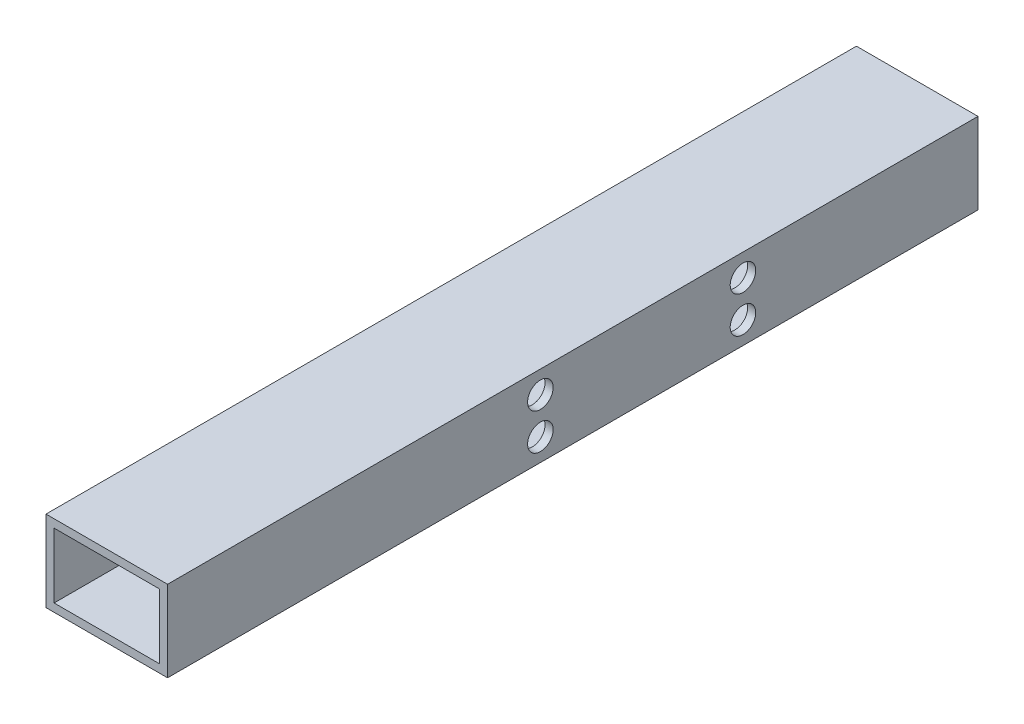
ISO-10303-21;
HEADER;
FILE_DESCRIPTION(('STEP AP214'),'2;1');
FILE_NAME('part.step','',(''),(''),'','','');
FILE_SCHEMA(('AUTOMOTIVE_DESIGN { 1 0 10303 214 1 1 1 1 }'));
ENDSEC;
DATA;
#1=APPLICATION_CONTEXT('core data for automotive mechanical design processes');
#2=APPLICATION_PROTOCOL_DEFINITION('international standard','automotive_design',2000,#1);
#3=PRODUCT_CONTEXT('',#1,'mechanical');
#4=PRODUCT('Part','Part','',(#3));
#5=PRODUCT_RELATED_PRODUCT_CATEGORY('part','',(#4));
#6=PRODUCT_DEFINITION_FORMATION('','',#4);
#7=PRODUCT_DEFINITION_CONTEXT('part definition',#1,'design');
#8=PRODUCT_DEFINITION('design','',#6,#7);
#9=PRODUCT_DEFINITION_SHAPE('','',#8);
#10=(LENGTH_UNIT() NAMED_UNIT(*) SI_UNIT(.MILLI.,.METRE.));
#11=(NAMED_UNIT(*) PLANE_ANGLE_UNIT() SI_UNIT($,.RADIAN.));
#12=(NAMED_UNIT(*) SI_UNIT($,.STERADIAN.) SOLID_ANGLE_UNIT());
#13=UNCERTAINTY_MEASURE_WITH_UNIT(LENGTH_MEASURE(1.E-05),#10,'distance_accuracy_value','');
#14=(GEOMETRIC_REPRESENTATION_CONTEXT(3) GLOBAL_UNCERTAINTY_ASSIGNED_CONTEXT((#13)) GLOBAL_UNIT_ASSIGNED_CONTEXT((#10,
#11,#12)) REPRESENTATION_CONTEXT('',''));
#15=CARTESIAN_POINT('',(0.,0.,0.));
#16=DIRECTION('',(0.,0.,1.));
#17=DIRECTION('',(1.,0.,0.));
#18=AXIS2_PLACEMENT_3D('',#15,#16,#17);
#19=CARTESIAN_POINT('',(-15.,10.,200.));
#20=DIRECTION('',(0.,0.,-1.));
#21=DIRECTION('',(-1.,0.,0.));
#22=AXIS2_PLACEMENT_3D('',#19,#20,#21);
#23=PLANE('',#22);
#24=DIRECTION('',(0.,-1.,0.));
#25=VECTOR('',#24,1.);
#26=CARTESIAN_POINT('',(-15.,-10.,200.));
#27=LINE('',#26,#25);
#28=CARTESIAN_POINT('',(-15.,10.,200.));
#29=VERTEX_POINT('',#28);
#30=CARTESIAN_POINT('',(-15.,-10.,200.));
#31=VERTEX_POINT('',#30);
#32=EDGE_CURVE('E135',#29,#31,#27,.T.);
#33=ORIENTED_EDGE('',*,*,#32,.T.);
#34=DIRECTION('',(1.,0.,0.));
#35=VECTOR('',#34,1.);
#36=CARTESIAN_POINT('',(-15.,-10.,200.));
#37=LINE('',#36,#35);
#38=CARTESIAN_POINT('',(15.,-10.,200.));
#39=VERTEX_POINT('',#38);
#40=EDGE_CURVE('E138',#31,#39,#37,.T.);
#41=ORIENTED_EDGE('',*,*,#40,.T.);
#42=DIRECTION('',(0.,1.,0.));
#43=VECTOR('',#42,1.);
#44=CARTESIAN_POINT('',(15.,-10.,200.));
#45=LINE('',#44,#43);
#46=CARTESIAN_POINT('',(15.,10.,200.));
#47=VERTEX_POINT('',#46);
#48=EDGE_CURVE('E141',#39,#47,#45,.T.);
#49=ORIENTED_EDGE('',*,*,#48,.T.);
#50=DIRECTION('',(-1.,0.,0.));
#51=VECTOR('',#50,1.);
#52=CARTESIAN_POINT('',(-15.,10.,200.));
#53=LINE('',#52,#51);
#54=EDGE_CURVE('E143',#47,#29,#53,.T.);
#55=ORIENTED_EDGE('',*,*,#54,.T.);
#56=EDGE_LOOP('',(#33,#41,#49,#55));
#57=FACE_BOUND('',#56,.T.);
#58=DIRECTION('',(0.,1.,0.));
#59=VECTOR('',#58,1.);
#60=CARTESIAN_POINT('',(13.,-8.,200.));
#61=LINE('',#60,#59);
#62=CARTESIAN_POINT('',(13.,-8.,200.));
#63=VERTEX_POINT('',#62);
#64=CARTESIAN_POINT('',(13.,8.,200.));
#65=VERTEX_POINT('',#64);
#66=EDGE_CURVE('E97',#63,#65,#61,.T.);
#67=ORIENTED_EDGE('',*,*,#66,.F.);
#68=DIRECTION('',(1.,0.,0.));
#69=VECTOR('',#68,1.);
#70=CARTESIAN_POINT('',(-13.,-8.,200.));
#71=LINE('',#70,#69);
#72=CARTESIAN_POINT('',(-13.,-8.,200.));
#73=VERTEX_POINT('',#72);
#74=EDGE_CURVE('E119',#73,#63,#71,.T.);
#75=ORIENTED_EDGE('',*,*,#74,.F.);
#76=DIRECTION('',(0.,-1.,0.));
#77=VECTOR('',#76,1.);
#78=CARTESIAN_POINT('',(-13.,-8.,200.));
#79=LINE('',#78,#77);
#80=CARTESIAN_POINT('',(-13.,8.,200.));
#81=VERTEX_POINT('',#80);
#82=EDGE_CURVE('E117',#81,#73,#79,.T.);
#83=ORIENTED_EDGE('',*,*,#82,.F.);
#84=DIRECTION('',(-1.,0.,0.));
#85=VECTOR('',#84,1.);
#86=CARTESIAN_POINT('',(-13.,8.,200.));
#87=LINE('',#86,#85);
#88=EDGE_CURVE('E105',#65,#81,#87,.T.);
#89=ORIENTED_EDGE('',*,*,#88,.F.);
#90=EDGE_LOOP('',(#67,#75,#83,#89));
#91=FACE_BOUND('',#90,.T.);
#92=ADVANCED_FACE('F30',(#57,#91),#23,.F.);
#93=CARTESIAN_POINT('',(-15.,10.,0.));
#94=DIRECTION('',(0.,0.,-1.));
#95=DIRECTION('',(-1.,0.,0.));
#96=AXIS2_PLACEMENT_3D('',#93,#94,#95);
#97=PLANE('',#96);
#98=DIRECTION('',(0.,-1.,0.));
#99=VECTOR('',#98,1.);
#100=CARTESIAN_POINT('',(-15.,-10.,0.));
#101=LINE('',#100,#99);
#102=CARTESIAN_POINT('',(-15.,10.,0.));
#103=VERTEX_POINT('',#102);
#104=CARTESIAN_POINT('',(-15.,-10.,0.));
#105=VERTEX_POINT('',#104);
#106=EDGE_CURVE('E113',#103,#105,#101,.T.);
#107=ORIENTED_EDGE('',*,*,#106,.F.);
#108=DIRECTION('',(-1.,0.,0.));
#109=VECTOR('',#108,1.);
#110=CARTESIAN_POINT('',(-15.,10.,0.));
#111=LINE('',#110,#109);
#112=CARTESIAN_POINT('',(15.,10.,0.));
#113=VERTEX_POINT('',#112);
#114=EDGE_CURVE('E139',#113,#103,#111,.T.);
#115=ORIENTED_EDGE('',*,*,#114,.F.);
#116=DIRECTION('',(0.,1.,0.));
#117=VECTOR('',#116,1.);
#118=CARTESIAN_POINT('',(15.,-10.,0.));
#119=LINE('',#118,#117);
#120=CARTESIAN_POINT('',(15.,-10.,0.));
#121=VERTEX_POINT('',#120);
#122=EDGE_CURVE('E150',#121,#113,#119,.T.);
#123=ORIENTED_EDGE('',*,*,#122,.F.);
#124=DIRECTION('',(1.,0.,0.));
#125=VECTOR('',#124,1.);
#126=CARTESIAN_POINT('',(-15.,-10.,0.));
#127=LINE('',#126,#125);
#128=EDGE_CURVE('E148',#105,#121,#127,.T.);
#129=ORIENTED_EDGE('',*,*,#128,.F.);
#130=EDGE_LOOP('',(#107,#115,#123,#129));
#131=FACE_BOUND('',#130,.T.);
#132=DIRECTION('',(1.,0.,0.));
#133=VECTOR('',#132,1.);
#134=CARTESIAN_POINT('',(-13.,-8.,0.));
#135=LINE('',#134,#133);
#136=CARTESIAN_POINT('',(-13.,-8.,0.));
#137=VERTEX_POINT('',#136);
#138=CARTESIAN_POINT('',(13.,-8.,0.));
#139=VERTEX_POINT('',#138);
#140=EDGE_CURVE('E106',#137,#139,#135,.T.);
#141=ORIENTED_EDGE('',*,*,#140,.T.);
#142=DIRECTION('',(0.,1.,0.));
#143=VECTOR('',#142,1.);
#144=CARTESIAN_POINT('',(13.,-8.,0.));
#145=LINE('',#144,#143);
#146=CARTESIAN_POINT('',(13.,8.,0.));
#147=VERTEX_POINT('',#146);
#148=EDGE_CURVE('E55',#139,#147,#145,.T.);
#149=ORIENTED_EDGE('',*,*,#148,.T.);
#150=DIRECTION('',(-1.,0.,0.));
#151=VECTOR('',#150,1.);
#152=CARTESIAN_POINT('',(-13.,8.,0.));
#153=LINE('',#152,#151);
#154=CARTESIAN_POINT('',(-13.,8.,0.));
#155=VERTEX_POINT('',#154);
#156=EDGE_CURVE('E112',#147,#155,#153,.T.);
#157=ORIENTED_EDGE('',*,*,#156,.T.);
#158=DIRECTION('',(0.,-1.,0.));
#159=VECTOR('',#158,1.);
#160=CARTESIAN_POINT('',(-13.,-8.,0.));
#161=LINE('',#160,#159);
#162=EDGE_CURVE('E127',#155,#137,#161,.T.);
#163=ORIENTED_EDGE('',*,*,#162,.T.);
#164=EDGE_LOOP('',(#141,#149,#157,#163));
#165=FACE_BOUND('',#164,.T.);
#166=ADVANCED_FACE('F225',(#131,#165),#97,.T.);
#167=CARTESIAN_POINT('',(-15.,-10.,200.));
#168=DIRECTION('',(1.,0.,0.));
#169=DIRECTION('',(0.,0.,-1.));
#170=AXIS2_PLACEMENT_3D('',#167,#168,#169);
#171=PLANE('',#170);
#172=CARTESIAN_POINT('',(-15.,-4.5,108.000000000001));
#173=DIRECTION('',(1.,0.,0.));
#174=DIRECTION('',(0.,0.,-1.));
#175=AXIS2_PLACEMENT_3D('',#172,#173,#174);
#176=CIRCLE('',#175,1.60000000000001);
#177=CARTESIAN_POINT('',(-15.,-4.5,106.400000000001));
#178=VERTEX_POINT('',#177);
#179=EDGE_CURVE('E174',#178,#178,#176,.T.);
#180=ORIENTED_EDGE('',*,*,#179,.T.);
#181=EDGE_LOOP('',(#180));
#182=FACE_BOUND('',#181,.T.);
#183=CARTESIAN_POINT('',(-15.,4.5,108.000000000001));
#184=DIRECTION('',(1.,0.,0.));
#185=DIRECTION('',(0.,0.,-1.));
#186=AXIS2_PLACEMENT_3D('',#183,#184,#185);
#187=CIRCLE('',#186,1.60000000000001);
#188=CARTESIAN_POINT('',(-15.,4.5,106.400000000001));
#189=VERTEX_POINT('',#188);
#190=EDGE_CURVE('E170',#189,#189,#187,.T.);
#191=ORIENTED_EDGE('',*,*,#190,.T.);
#192=EDGE_LOOP('',(#191));
#193=FACE_BOUND('',#192,.T.);
#194=CARTESIAN_POINT('',(-15.,4.5,58.000000000001));
#195=DIRECTION('',(1.,0.,0.));
#196=DIRECTION('',(0.,0.,-1.));
#197=AXIS2_PLACEMENT_3D('',#194,#195,#196);
#198=CIRCLE('',#197,1.6);
#199=CARTESIAN_POINT('',(-15.,4.5,56.400000000001));
#200=VERTEX_POINT('',#199);
#201=EDGE_CURVE('E166',#200,#200,#198,.T.);
#202=ORIENTED_EDGE('',*,*,#201,.T.);
#203=EDGE_LOOP('',(#202));
#204=FACE_BOUND('',#203,.T.);
#205=CARTESIAN_POINT('',(-15.,-4.5,58.000000000001));
#206=DIRECTION('',(1.,0.,0.));
#207=DIRECTION('',(0.,0.,-1.));
#208=AXIS2_PLACEMENT_3D('',#205,#206,#207);
#209=CIRCLE('',#208,1.6);
#210=CARTESIAN_POINT('',(-15.,-4.5,56.400000000001));
#211=VERTEX_POINT('',#210);
#212=EDGE_CURVE('E162',#211,#211,#209,.T.);
#213=ORIENTED_EDGE('',*,*,#212,.T.);
#214=EDGE_LOOP('',(#213));
#215=FACE_BOUND('',#214,.T.);
#216=ORIENTED_EDGE('',*,*,#106,.T.);
#217=DIRECTION('',(0.,0.,-1.));
#218=VECTOR('',#217,1.);
#219=CARTESIAN_POINT('',(-15.,-10.,200.));
#220=LINE('',#219,#218);
#221=EDGE_CURVE('E11',#31,#105,#220,.T.);
#222=ORIENTED_EDGE('',*,*,#221,.F.);
#223=ORIENTED_EDGE('',*,*,#32,.F.);
#224=DIRECTION('',(0.,0.,-1.));
#225=VECTOR('',#224,1.);
#226=CARTESIAN_POINT('',(-15.,10.,200.));
#227=LINE('',#226,#225);
#228=EDGE_CURVE('E145',#29,#103,#227,.T.);
#229=ORIENTED_EDGE('',*,*,#228,.T.);
#230=EDGE_LOOP('',(#216,#222,#223,#229));
#231=FACE_BOUND('',#230,.T.);
#232=ADVANCED_FACE('F32',(#182,#193,#204,#215,#231),#171,.F.);
#233=CARTESIAN_POINT('',(-15.,-10.,200.));
#234=DIRECTION('',(0.,1.,0.));
#235=DIRECTION('',(0.,0.,1.));
#236=AXIS2_PLACEMENT_3D('',#233,#234,#235);
#237=PLANE('',#236);
#238=ORIENTED_EDGE('',*,*,#128,.T.);
#239=DIRECTION('',(0.,0.,-1.));
#240=VECTOR('',#239,1.);
#241=CARTESIAN_POINT('',(15.,-10.,200.));
#242=LINE('',#241,#240);
#243=EDGE_CURVE('E39',#39,#121,#242,.T.);
#244=ORIENTED_EDGE('',*,*,#243,.F.);
#245=ORIENTED_EDGE('',*,*,#40,.F.);
#246=ORIENTED_EDGE('',*,*,#221,.T.);
#247=EDGE_LOOP('',(#238,#244,#245,#246));
#248=FACE_BOUND('',#247,.T.);
#249=ADVANCED_FACE('F242',(#248),#237,.F.);
#250=CARTESIAN_POINT('',(15.,-10.,200.));
#251=DIRECTION('',(-1.,0.,0.));
#252=DIRECTION('',(0.,0.,1.));
#253=AXIS2_PLACEMENT_3D('',#250,#251,#252);
#254=PLANE('',#253);
#255=CARTESIAN_POINT('',(15.,4.5,58.000000000001));
#256=DIRECTION('',(1.,0.,0.));
#257=DIRECTION('',(0.,0.,-1.));
#258=AXIS2_PLACEMENT_3D('',#255,#256,#257);
#259=CIRCLE('',#258,3.15);
#260=CARTESIAN_POINT('',(15.,4.5,54.850000000001));
#261=VERTEX_POINT('',#260);
#262=EDGE_CURVE('E194',#261,#261,#259,.T.);
#263=ORIENTED_EDGE('',*,*,#262,.F.);
#264=EDGE_LOOP('',(#263));
#265=FACE_BOUND('',#264,.T.);
#266=CARTESIAN_POINT('',(15.,-4.5,58.000000000001));
#267=DIRECTION('',(1.,0.,0.));
#268=DIRECTION('',(0.,0.,-1.));
#269=AXIS2_PLACEMENT_3D('',#266,#267,#268);
#270=CIRCLE('',#269,3.15);
#271=CARTESIAN_POINT('',(15.,-4.5,54.850000000001));
#272=VERTEX_POINT('',#271);
#273=EDGE_CURVE('E184',#272,#272,#270,.T.);
#274=ORIENTED_EDGE('',*,*,#273,.F.);
#275=EDGE_LOOP('',(#274));
#276=FACE_BOUND('',#275,.T.);
#277=CARTESIAN_POINT('',(15.,4.5,108.000000000001));
#278=DIRECTION('',(1.,0.,0.));
#279=DIRECTION('',(0.,0.,-1.));
#280=AXIS2_PLACEMENT_3D('',#277,#278,#279);
#281=CIRCLE('',#280,3.15);
#282=CARTESIAN_POINT('',(15.,4.5,104.850000000001));
#283=VERTEX_POINT('',#282);
#284=EDGE_CURVE('E181',#283,#283,#281,.T.);
#285=ORIENTED_EDGE('',*,*,#284,.F.);
#286=EDGE_LOOP('',(#285));
#287=FACE_BOUND('',#286,.T.);
#288=CARTESIAN_POINT('',(15.,-4.5,108.000000000001));
#289=DIRECTION('',(1.,0.,0.));
#290=DIRECTION('',(0.,0.,-1.));
#291=AXIS2_PLACEMENT_3D('',#288,#289,#290);
#292=CIRCLE('',#291,3.15);
#293=CARTESIAN_POINT('',(15.,-4.5,104.850000000001));
#294=VERTEX_POINT('',#293);
#295=EDGE_CURVE('E178',#294,#294,#292,.T.);
#296=ORIENTED_EDGE('',*,*,#295,.F.);
#297=EDGE_LOOP('',(#296));
#298=FACE_BOUND('',#297,.T.);
#299=ORIENTED_EDGE('',*,*,#122,.T.);
#300=DIRECTION('',(0.,0.,-1.));
#301=VECTOR('',#300,1.);
#302=CARTESIAN_POINT('',(15.,10.,200.));
#303=LINE('',#302,#301);
#304=EDGE_CURVE('E155',#47,#113,#303,.T.);
#305=ORIENTED_EDGE('',*,*,#304,.F.);
#306=ORIENTED_EDGE('',*,*,#48,.F.);
#307=ORIENTED_EDGE('',*,*,#243,.T.);
#308=EDGE_LOOP('',(#299,#305,#306,#307));
#309=FACE_BOUND('',#308,.T.);
#310=ADVANCED_FACE('F239',(#265,#276,#287,#298,#309),#254,.F.);
#311=CARTESIAN_POINT('',(-15.,10.,200.));
#312=DIRECTION('',(0.,-1.,0.));
#313=DIRECTION('',(0.,0.,-1.));
#314=AXIS2_PLACEMENT_3D('',#311,#312,#313);
#315=PLANE('',#314);
#316=ORIENTED_EDGE('',*,*,#114,.T.);
#317=ORIENTED_EDGE('',*,*,#228,.F.);
#318=ORIENTED_EDGE('',*,*,#54,.F.);
#319=ORIENTED_EDGE('',*,*,#304,.T.);
#320=EDGE_LOOP('',(#316,#317,#318,#319));
#321=FACE_BOUND('',#320,.T.);
#322=ADVANCED_FACE('F236',(#321),#315,.F.);
#323=CARTESIAN_POINT('',(13.,-8.,200.));
#324=DIRECTION('',(-1.,0.,0.));
#325=DIRECTION('',(0.,0.,1.));
#326=AXIS2_PLACEMENT_3D('',#323,#324,#325);
#327=PLANE('',#326);
#328=CARTESIAN_POINT('',(13.,4.5,58.000000000001));
#329=DIRECTION('',(-1.,0.,0.));
#330=DIRECTION('',(0.,0.,1.));
#331=AXIS2_PLACEMENT_3D('',#328,#329,#330);
#332=CIRCLE('',#331,3.15);
#333=CARTESIAN_POINT('',(13.,4.5,61.150000000001));
#334=VERTEX_POINT('',#333);
#335=EDGE_CURVE('E34',#334,#334,#332,.T.);
#336=ORIENTED_EDGE('',*,*,#335,.F.);
#337=EDGE_LOOP('',(#336));
#338=FACE_BOUND('',#337,.T.);
#339=CARTESIAN_POINT('',(13.,-4.5,58.000000000001));
#340=DIRECTION('',(-1.,0.,0.));
#341=DIRECTION('',(0.,0.,1.));
#342=AXIS2_PLACEMENT_3D('',#339,#340,#341);
#343=CIRCLE('',#342,3.15);
#344=CARTESIAN_POINT('',(13.,-4.5,61.150000000001));
#345=VERTEX_POINT('',#344);
#346=EDGE_CURVE('E182',#345,#345,#343,.T.);
#347=ORIENTED_EDGE('',*,*,#346,.F.);
#348=EDGE_LOOP('',(#347));
#349=FACE_BOUND('',#348,.T.);
#350=CARTESIAN_POINT('',(13.,4.5,108.000000000001));
#351=DIRECTION('',(-1.,0.,0.));
#352=DIRECTION('',(0.,0.,1.));
#353=AXIS2_PLACEMENT_3D('',#350,#351,#352);
#354=CIRCLE('',#353,3.15);
#355=CARTESIAN_POINT('',(13.,4.5,111.150000000001));
#356=VERTEX_POINT('',#355);
#357=EDGE_CURVE('E179',#356,#356,#354,.T.);
#358=ORIENTED_EDGE('',*,*,#357,.F.);
#359=EDGE_LOOP('',(#358));
#360=FACE_BOUND('',#359,.T.);
#361=CARTESIAN_POINT('',(13.,-4.5,108.000000000001));
#362=DIRECTION('',(-1.,0.,0.));
#363=DIRECTION('',(0.,0.,1.));
#364=AXIS2_PLACEMENT_3D('',#361,#362,#363);
#365=CIRCLE('',#364,3.15);
#366=CARTESIAN_POINT('',(13.,-4.5,111.150000000001));
#367=VERTEX_POINT('',#366);
#368=EDGE_CURVE('E175',#367,#367,#365,.T.);
#369=ORIENTED_EDGE('',*,*,#368,.F.);
#370=EDGE_LOOP('',(#369));
#371=FACE_BOUND('',#370,.T.);
#372=ORIENTED_EDGE('',*,*,#148,.F.);
#373=DIRECTION('',(0.,0.,-1.));
#374=VECTOR('',#373,1.);
#375=CARTESIAN_POINT('',(13.,-8.,200.));
#376=LINE('',#375,#374);
#377=EDGE_CURVE('E101',#63,#139,#376,.T.);
#378=ORIENTED_EDGE('',*,*,#377,.F.);
#379=ORIENTED_EDGE('',*,*,#66,.T.);
#380=DIRECTION('',(0.,0.,-1.));
#381=VECTOR('',#380,1.);
#382=CARTESIAN_POINT('',(13.,8.,200.));
#383=LINE('',#382,#381);
#384=EDGE_CURVE('E100',#65,#147,#383,.T.);
#385=ORIENTED_EDGE('',*,*,#384,.T.);
#386=EDGE_LOOP('',(#372,#378,#379,#385));
#387=FACE_BOUND('',#386,.T.);
#388=ADVANCED_FACE('F99',(#338,#349,#360,#371,#387),#327,.T.);
#389=CARTESIAN_POINT('',(-13.,8.,200.));
#390=DIRECTION('',(0.,-1.,0.));
#391=DIRECTION('',(0.,0.,-1.));
#392=AXIS2_PLACEMENT_3D('',#389,#390,#391);
#393=PLANE('',#392);
#394=ORIENTED_EDGE('',*,*,#156,.F.);
#395=ORIENTED_EDGE('',*,*,#384,.F.);
#396=ORIENTED_EDGE('',*,*,#88,.T.);
#397=DIRECTION('',(0.,0.,-1.));
#398=VECTOR('',#397,1.);
#399=CARTESIAN_POINT('',(-13.,8.,200.));
#400=LINE('',#399,#398);
#401=EDGE_CURVE('E114',#81,#155,#400,.T.);
#402=ORIENTED_EDGE('',*,*,#401,.T.);
#403=EDGE_LOOP('',(#394,#395,#396,#402));
#404=FACE_BOUND('',#403,.T.);
#405=ADVANCED_FACE('F109',(#404),#393,.T.);
#406=CARTESIAN_POINT('',(-13.,-8.,200.));
#407=DIRECTION('',(1.,0.,0.));
#408=DIRECTION('',(0.,0.,-1.));
#409=AXIS2_PLACEMENT_3D('',#406,#407,#408);
#410=PLANE('',#409);
#411=CARTESIAN_POINT('',(-13.,-4.5,108.000000000001));
#412=DIRECTION('',(1.,0.,0.));
#413=DIRECTION('',(0.,0.,-1.));
#414=AXIS2_PLACEMENT_3D('',#411,#412,#413);
#415=CIRCLE('',#414,1.60000000000001);
#416=CARTESIAN_POINT('',(-13.,-4.5,106.400000000001));
#417=VERTEX_POINT('',#416);
#418=EDGE_CURVE('E171',#417,#417,#415,.T.);
#419=ORIENTED_EDGE('',*,*,#418,.F.);
#420=EDGE_LOOP('',(#419));
#421=FACE_BOUND('',#420,.T.);
#422=CARTESIAN_POINT('',(-13.,4.5,108.000000000001));
#423=DIRECTION('',(1.,0.,0.));
#424=DIRECTION('',(0.,0.,-1.));
#425=AXIS2_PLACEMENT_3D('',#422,#423,#424);
#426=CIRCLE('',#425,1.60000000000001);
#427=CARTESIAN_POINT('',(-13.,4.5,106.400000000001));
#428=VERTEX_POINT('',#427);
#429=EDGE_CURVE('E167',#428,#428,#426,.T.);
#430=ORIENTED_EDGE('',*,*,#429,.F.);
#431=EDGE_LOOP('',(#430));
#432=FACE_BOUND('',#431,.T.);
#433=CARTESIAN_POINT('',(-13.,4.5,58.000000000001));
#434=DIRECTION('',(1.,0.,0.));
#435=DIRECTION('',(0.,0.,-1.));
#436=AXIS2_PLACEMENT_3D('',#433,#434,#435);
#437=CIRCLE('',#436,1.6);
#438=CARTESIAN_POINT('',(-13.,4.5,56.400000000001));
#439=VERTEX_POINT('',#438);
#440=EDGE_CURVE('E163',#439,#439,#437,.T.);
#441=ORIENTED_EDGE('',*,*,#440,.F.);
#442=EDGE_LOOP('',(#441));
#443=FACE_BOUND('',#442,.T.);
#444=CARTESIAN_POINT('',(-13.,-4.5,58.000000000001));
#445=DIRECTION('',(1.,0.,0.));
#446=DIRECTION('',(0.,0.,-1.));
#447=AXIS2_PLACEMENT_3D('',#444,#445,#446);
#448=CIRCLE('',#447,1.6);
#449=CARTESIAN_POINT('',(-13.,-4.5,56.400000000001));
#450=VERTEX_POINT('',#449);
#451=EDGE_CURVE('E125',#450,#450,#448,.T.);
#452=ORIENTED_EDGE('',*,*,#451,.F.);
#453=EDGE_LOOP('',(#452));
#454=FACE_BOUND('',#453,.T.);
#455=ORIENTED_EDGE('',*,*,#162,.F.);
#456=ORIENTED_EDGE('',*,*,#401,.F.);
#457=ORIENTED_EDGE('',*,*,#82,.T.);
#458=DIRECTION('',(0.,0.,-1.));
#459=VECTOR('',#458,1.);
#460=CARTESIAN_POINT('',(-13.,-8.,200.));
#461=LINE('',#460,#459);
#462=EDGE_CURVE('E47',#73,#137,#461,.T.);
#463=ORIENTED_EDGE('',*,*,#462,.T.);
#464=EDGE_LOOP('',(#455,#456,#457,#463));
#465=FACE_BOUND('',#464,.T.);
#466=ADVANCED_FACE('F222',(#421,#432,#443,#454,#465),#410,.T.);
#467=CARTESIAN_POINT('',(-13.,-8.,200.));
#468=DIRECTION('',(0.,1.,0.));
#469=DIRECTION('',(0.,0.,1.));
#470=AXIS2_PLACEMENT_3D('',#467,#468,#469);
#471=PLANE('',#470);
#472=ORIENTED_EDGE('',*,*,#140,.F.);
#473=ORIENTED_EDGE('',*,*,#462,.F.);
#474=ORIENTED_EDGE('',*,*,#74,.T.);
#475=ORIENTED_EDGE('',*,*,#377,.T.);
#476=EDGE_LOOP('',(#472,#473,#474,#475));
#477=FACE_BOUND('',#476,.T.);
#478=ADVANCED_FACE('F212',(#477),#471,.T.);
#479=CARTESIAN_POINT('',(-15.,-4.5,58.000000000001));
#480=DIRECTION('',(1.,0.,0.));
#481=DIRECTION('',(0.,0.,-1.));
#482=AXIS2_PLACEMENT_3D('',#479,#480,#481);
#483=CYLINDRICAL_SURFACE('',#482,1.6);
#484=ORIENTED_EDGE('',*,*,#451,.T.);
#485=EDGE_LOOP('',(#484));
#486=FACE_BOUND('',#485,.T.);
#487=ORIENTED_EDGE('',*,*,#212,.F.);
#488=EDGE_LOOP('',(#487));
#489=FACE_BOUND('',#488,.T.);
#490=ADVANCED_FACE('F209',(#486,#489),#483,.F.);
#491=CARTESIAN_POINT('',(-15.,4.5,58.000000000001));
#492=DIRECTION('',(1.,0.,0.));
#493=DIRECTION('',(0.,0.,-1.));
#494=AXIS2_PLACEMENT_3D('',#491,#492,#493);
#495=CYLINDRICAL_SURFACE('',#494,1.6);
#496=ORIENTED_EDGE('',*,*,#440,.T.);
#497=EDGE_LOOP('',(#496));
#498=FACE_BOUND('',#497,.T.);
#499=ORIENTED_EDGE('',*,*,#201,.F.);
#500=EDGE_LOOP('',(#499));
#501=FACE_BOUND('',#500,.T.);
#502=ADVANCED_FACE('F211',(#498,#501),#495,.F.);
#503=CARTESIAN_POINT('',(-15.,4.5,108.000000000001));
#504=DIRECTION('',(1.,0.,0.));
#505=DIRECTION('',(0.,0.,-1.));
#506=AXIS2_PLACEMENT_3D('',#503,#504,#505);
#507=CYLINDRICAL_SURFACE('',#506,1.60000000000001);
#508=ORIENTED_EDGE('',*,*,#429,.T.);
#509=EDGE_LOOP('',(#508));
#510=FACE_BOUND('',#509,.T.);
#511=ORIENTED_EDGE('',*,*,#190,.F.);
#512=EDGE_LOOP('',(#511));
#513=FACE_BOUND('',#512,.T.);
#514=ADVANCED_FACE('F219',(#510,#513),#507,.F.);
#515=CARTESIAN_POINT('',(-15.,-4.5,108.000000000001));
#516=DIRECTION('',(1.,0.,0.));
#517=DIRECTION('',(0.,0.,-1.));
#518=AXIS2_PLACEMENT_3D('',#515,#516,#517);
#519=CYLINDRICAL_SURFACE('',#518,1.60000000000001);
#520=ORIENTED_EDGE('',*,*,#418,.T.);
#521=EDGE_LOOP('',(#520));
#522=FACE_BOUND('',#521,.T.);
#523=ORIENTED_EDGE('',*,*,#179,.F.);
#524=EDGE_LOOP('',(#523));
#525=FACE_BOUND('',#524,.T.);
#526=ADVANCED_FACE('F283',(#522,#525),#519,.F.);
#527=CARTESIAN_POINT('',(12.,-4.5,108.000000000001));
#528=DIRECTION('',(1.,0.,0.));
#529=DIRECTION('',(0.,0.,-1.));
#530=AXIS2_PLACEMENT_3D('',#527,#528,#529);
#531=CYLINDRICAL_SURFACE('',#530,3.15);
#532=ORIENTED_EDGE('',*,*,#368,.T.);
#533=EDGE_LOOP('',(#532));
#534=FACE_BOUND('',#533,.T.);
#535=ORIENTED_EDGE('',*,*,#295,.T.);
#536=EDGE_LOOP('',(#535));
#537=FACE_BOUND('',#536,.T.);
#538=ADVANCED_FACE('F290',(#534,#537),#531,.F.);
#539=CARTESIAN_POINT('',(12.,4.5,108.000000000001));
#540=DIRECTION('',(1.,0.,0.));
#541=DIRECTION('',(0.,0.,-1.));
#542=AXIS2_PLACEMENT_3D('',#539,#540,#541);
#543=CYLINDRICAL_SURFACE('',#542,3.15);
#544=ORIENTED_EDGE('',*,*,#357,.T.);
#545=EDGE_LOOP('',(#544));
#546=FACE_BOUND('',#545,.T.);
#547=ORIENTED_EDGE('',*,*,#284,.T.);
#548=EDGE_LOOP('',(#547));
#549=FACE_BOUND('',#548,.T.);
#550=ADVANCED_FACE('F296',(#546,#549),#543,.F.);
#551=CARTESIAN_POINT('',(12.,-4.5,58.000000000001));
#552=DIRECTION('',(1.,0.,0.));
#553=DIRECTION('',(0.,0.,-1.));
#554=AXIS2_PLACEMENT_3D('',#551,#552,#553);
#555=CYLINDRICAL_SURFACE('',#554,3.15);
#556=ORIENTED_EDGE('',*,*,#346,.T.);
#557=EDGE_LOOP('',(#556));
#558=FACE_BOUND('',#557,.T.);
#559=ORIENTED_EDGE('',*,*,#273,.T.);
#560=EDGE_LOOP('',(#559));
#561=FACE_BOUND('',#560,.T.);
#562=ADVANCED_FACE('F300',(#558,#561),#555,.F.);
#563=CARTESIAN_POINT('',(12.,4.5,58.000000000001));
#564=DIRECTION('',(1.,0.,0.));
#565=DIRECTION('',(0.,0.,-1.));
#566=AXIS2_PLACEMENT_3D('',#563,#564,#565);
#567=CYLINDRICAL_SURFACE('',#566,3.15);
#568=ORIENTED_EDGE('',*,*,#335,.T.);
#569=EDGE_LOOP('',(#568));
#570=FACE_BOUND('',#569,.T.);
#571=ORIENTED_EDGE('',*,*,#262,.T.);
#572=EDGE_LOOP('',(#571));
#573=FACE_BOUND('',#572,.T.);
#574=ADVANCED_FACE('F304',(#570,#573),#567,.F.);
#575=CLOSED_SHELL('',(#92,#166,#232,#249,#310,#322,#388,#405,#466,#478,#490,#502,#514,#526,#538,
#550,#562,#574));
#576=MANIFOLD_SOLID_BREP('B2',#575);
#577=ADVANCED_BREP_SHAPE_REPRESENTATION('',(#18,#576),#14);
#578=SHAPE_DEFINITION_REPRESENTATION(#9,#577);
ENDSEC;
END-ISO-10303-21;
